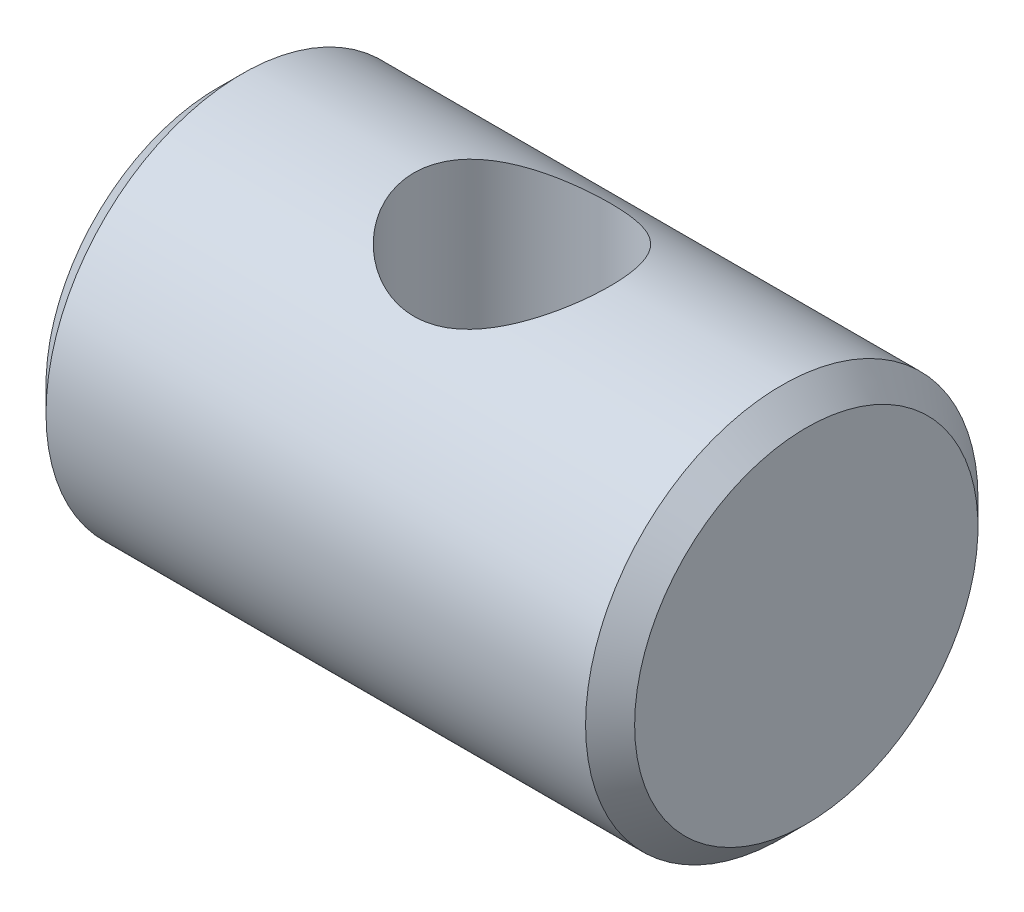
ISO-10303-21;
HEADER;
FILE_DESCRIPTION(('STEP AP214'),'2;1');
FILE_NAME('part.step','',(''),(''),'','','');
FILE_SCHEMA(('AUTOMOTIVE_DESIGN { 1 0 10303 214 1 1 1 1 }'));
ENDSEC;
DATA;
#1=APPLICATION_CONTEXT('core data for automotive mechanical design processes');
#2=APPLICATION_PROTOCOL_DEFINITION('international standard','automotive_design',2000,#1);
#3=PRODUCT_CONTEXT('',#1,'mechanical');
#4=PRODUCT('Part','Part','',(#3));
#5=PRODUCT_RELATED_PRODUCT_CATEGORY('part','',(#4));
#6=PRODUCT_DEFINITION_FORMATION('','',#4);
#7=PRODUCT_DEFINITION_CONTEXT('part definition',#1,'design');
#8=PRODUCT_DEFINITION('design','',#6,#7);
#9=PRODUCT_DEFINITION_SHAPE('','',#8);
#10=(LENGTH_UNIT() NAMED_UNIT(*) SI_UNIT(.MILLI.,.METRE.));
#11=(NAMED_UNIT(*) PLANE_ANGLE_UNIT() SI_UNIT($,.RADIAN.));
#12=(NAMED_UNIT(*) SI_UNIT($,.STERADIAN.) SOLID_ANGLE_UNIT());
#13=UNCERTAINTY_MEASURE_WITH_UNIT(LENGTH_MEASURE(1.E-05),#10,'distance_accuracy_value','');
#14=(GEOMETRIC_REPRESENTATION_CONTEXT(3) GLOBAL_UNCERTAINTY_ASSIGNED_CONTEXT((#13)) GLOBAL_UNIT_ASSIGNED_CONTEXT((#10,
#11,#12)) REPRESENTATION_CONTEXT('',''));
#15=CARTESIAN_POINT('',(0.,0.,0.));
#16=DIRECTION('',(0.,0.,1.));
#17=DIRECTION('',(1.,0.,0.));
#18=AXIS2_PLACEMENT_3D('',#15,#16,#17);
#19=CARTESIAN_POINT('',(0.,0.,0.));
#20=DIRECTION('',(-1.,0.,0.));
#21=DIRECTION('',(0.,0.,1.));
#22=AXIS2_PLACEMENT_3D('',#19,#20,#21);
#23=CYLINDRICAL_SURFACE('',#22,8.);
#24=CARTESIAN_POINT('',(23.,0.,0.));
#25=DIRECTION('',(-1.,0.,0.));
#26=DIRECTION('',(0.,0.,1.));
#27=AXIS2_PLACEMENT_3D('',#24,#25,#26);
#28=CIRCLE('',#27,8.);
#29=CARTESIAN_POINT('',(23.,0.,8.));
#30=VERTEX_POINT('',#29);
#31=EDGE_CURVE('E43',#30,#30,#28,.T.);
#32=ORIENTED_EDGE('',*,*,#31,.T.);
#33=EDGE_LOOP('',(#32));
#34=FACE_BOUND('',#33,.T.);
#35=CARTESIAN_POINT('',(0.999999999999997,0.,0.));
#36=DIRECTION('',(1.,0.,0.));
#37=DIRECTION('',(0.,0.,-1.));
#38=AXIS2_PLACEMENT_3D('',#35,#36,#37);
#39=CIRCLE('',#38,8.);
#40=CARTESIAN_POINT('',(0.999999999999997,0.,-8.));
#41=VERTEX_POINT('',#40);
#42=EDGE_CURVE('E47',#41,#41,#39,.T.);
#43=ORIENTED_EDGE('',*,*,#42,.T.);
#44=EDGE_LOOP('',(#43));
#45=FACE_BOUND('',#44,.T.);
#46=CARTESIAN_POINT('',(12.,-6.92820323027551,4.));
#47=CARTESIAN_POINT('',(11.8957346745627,-6.92820386262827,3.99999950219345));
#48=CARTESIAN_POINT('',(11.7914600733206,-6.93056511456489,3.9959176319954));
#49=CARTESIAN_POINT('',(11.5837158253996,-6.93992172463862,3.97964472112407));
#50=CARTESIAN_POINT('',(11.4802465761673,-6.94691924018482,3.96744990521398));
#51=CARTESIAN_POINT('',(11.2747891544301,-6.96530330045203,3.93508538297522));
#52=CARTESIAN_POINT('',(11.1728035661705,-6.97669672816262,3.91490316893164));
#53=CARTESIAN_POINT('',(10.9711859983217,-7.00345973447504,3.86682062971258));
#54=CARTESIAN_POINT('',(10.8715550619573,-7.01883104071991,3.83891695064122));
#55=CARTESIAN_POINT('',(10.5783110339908,-7.06996541785761,3.74442772916634));
#56=CARTESIAN_POINT('',(10.389014143383,-7.11087904783326,3.66684915651285));
#57=CARTESIAN_POINT('',(10.026270436199,-7.20170927952068,3.48506075380109));
#58=CARTESIAN_POINT('',(9.85282447778058,-7.25162636823861,3.38084948302616));
#59=CARTESIAN_POINT('',(9.51079150565206,-7.35987226264081,3.13867639492104));
#60=CARTESIAN_POINT('',(9.34378513355238,-7.41855528289904,2.99863981046008));
#61=CARTESIAN_POINT('',(9.03434475935065,-7.53488657765781,2.69298354883075));
#62=CARTESIAN_POINT('',(8.89192301423607,-7.59253432325009,2.52735118809493));
#63=CARTESIAN_POINT('',(8.69501793351785,-7.6758759355965,2.25626437810991));
#64=CARTESIAN_POINT('',(8.63046773838086,-7.70394919240219,2.15870290429515));
#65=CARTESIAN_POINT('',(8.50989555977189,-7.75744193796062,1.95777427065882));
#66=CARTESIAN_POINT('',(8.45386995399076,-7.78286255243594,1.85440960246323));
#67=CARTESIAN_POINT('',(8.35088721834241,-7.83032159918279,1.64251485422606));
#68=CARTESIAN_POINT('',(8.3039299474101,-7.85236008406492,1.53398485456801));
#69=CARTESIAN_POINT('',(8.21963805173427,-7.89238619731919,1.31258580967489));
#70=CARTESIAN_POINT('',(8.18229801231068,-7.91037610439248,1.19971924732414));
#71=CARTESIAN_POINT('',(8.11998170572534,-7.94064573590697,0.978622575683237));
#72=CARTESIAN_POINT('',(8.09431784694156,-7.95323930006917,0.870629018183686));
#73=CARTESIAN_POINT('',(8.05202029256653,-7.97409583861317,0.652524088435718));
#74=CARTESIAN_POINT('',(8.03538217848428,-7.98236093189932,0.542413779814406));
#75=CARTESIAN_POINT('',(8.01134413300253,-7.99432715952591,0.320973525125332));
#76=CARTESIAN_POINT('',(8.00394155328386,-7.99802960221736,0.209643937931223));
#77=CARTESIAN_POINT('',(7.99846831363001,-8.0007656004484,-0.0132971447801776));
#78=CARTESIAN_POINT('',(8.00039708275485,-7.99979944163708,-0.124908622632319));
#79=CARTESIAN_POINT('',(8.01298520870728,-7.99351360464185,-0.337727985342427));
#80=CARTESIAN_POINT('',(8.02286802234914,-7.98858118408677,-0.438993817716942));
#81=CARTESIAN_POINT('',(8.05026327909606,-7.97497880011988,-0.640243249291358));
#82=CARTESIAN_POINT('',(8.06777817913607,-7.96630763313356,-0.740226424897069));
#83=CARTESIAN_POINT('',(8.13151052269444,-7.93497195498556,-1.03714138295469));
#84=CARTESIAN_POINT('',(8.18892789700107,-7.9069787607081,-1.23123936013571));
#85=CARTESIAN_POINT('',(8.3323339738856,-7.83886272517952,-1.60926871560141));
#86=CARTESIAN_POINT('',(8.41870698240342,-7.79857742343273,-1.79302228049015));
#87=CARTESIAN_POINT('',(8.61705193447081,-7.70950607728793,-2.14389861654609));
#88=CARTESIAN_POINT('',(8.72903304281444,-7.66071699099023,-2.31101540282593));
#89=CARTESIAN_POINT('',(8.98758491999729,-7.55377539869557,-2.64069813790285));
#90=CARTESIAN_POINT('',(9.13642476015339,-7.49517374441381,-2.80134064782814));
#91=CARTESIAN_POINT('',(9.45834624318657,-7.37817491997774,-3.096413130151));
#92=CARTESIAN_POINT('',(9.63144636282433,-7.31977794078032,-3.23082293513643));
#93=CARTESIAN_POINT('',(10.0106428886681,-7.20576112808082,-3.47803613314164));
#94=CARTESIAN_POINT('',(10.2181366185476,-7.15055315383099,-3.58892539602578));
#95=CARTESIAN_POINT('',(10.5434173844388,-7.07886925416583,-3.72723782010755));
#96=CARTESIAN_POINT('',(10.6542083591974,-7.05682593849463,-3.76867730715226));
#97=CARTESIAN_POINT('',(10.8797448467812,-7.01731299636541,-3.84175062064907));
#98=CARTESIAN_POINT('',(10.9944878725261,-6.99984055082837,-3.873390493228));
#99=CARTESIAN_POINT('',(11.2178286645174,-6.97140602598866,-3.92431909326377));
#100=CARTESIAN_POINT('',(11.3261986514601,-6.96003957007804,-3.94438433855719));
#101=CARTESIAN_POINT('',(11.5445809004778,-6.94230335544128,-3.97551851361913));
#102=CARTESIAN_POINT('',(11.6545922781344,-6.93593099829036,-3.98659212183614));
#103=CARTESIAN_POINT('',(11.8752925100327,-6.92844811909924,-3.99958291311109));
#104=CARTESIAN_POINT('',(11.9859810966268,-6.92733563775175,-4.00150350567568));
#105=CARTESIAN_POINT('',(12.2070566931056,-6.93041539174955,-3.99616718095744));
#106=CARTESIAN_POINT('',(12.3174437228426,-6.93460726902939,-3.98891088315149));
#107=CARTESIAN_POINT('',(12.5248693839796,-6.94737197203376,-3.96663154579714));
#108=CARTESIAN_POINT('',(12.6220432110123,-6.95541341326252,-3.95254845698989));
#109=CARTESIAN_POINT('',(12.8147319334338,-6.97528372672039,-3.91737385475212));
#110=CARTESIAN_POINT('',(12.9102462700362,-6.98711384958699,-3.89628002700135));
#111=CARTESIAN_POINT('',(13.1933680361081,-7.02775685901555,-3.82280238446313));
#112=CARTESIAN_POINT('',(13.3776914342727,-7.06173163693377,-3.76020731695078));
#113=CARTESIAN_POINT('',(13.7416745877016,-7.14144993292041,-3.60658595732554));
#114=CARTESIAN_POINT('',(13.920722953339,-7.18766564346826,-3.51437713951607));
#115=CARTESIAN_POINT('',(14.2618701966871,-7.28624486618865,-3.30514737086267));
#116=CARTESIAN_POINT('',(14.4239603033081,-7.33861153030439,-3.18811367399408));
#117=CARTESIAN_POINT('',(14.7479131228582,-7.45151836616993,-2.91535761342628));
#118=CARTESIAN_POINT('',(14.9071715871659,-7.51225675092662,-2.75661800037809));
#119=CARTESIAN_POINT('',(15.1976659734158,-7.62937597657745,-2.41358105803055));
#120=CARTESIAN_POINT('',(15.3288924296162,-7.68575534144675,-2.22927513013699));
#121=CARTESIAN_POINT('',(15.5032077822372,-7.76335543938379,-1.93419225408146));
#122=CARTESIAN_POINT('',(15.5581300572987,-7.78834354202674,-1.83122945254024));
#123=CARTESIAN_POINT('',(15.659005530877,-7.83494183925332,-1.62028527572799));
#124=CARTESIAN_POINT('',(15.7049627631382,-7.85655355213899,-1.51230618469744));
#125=CARTESIAN_POINT('',(15.7873743266401,-7.89575152015211,-1.29213403393068));
#126=CARTESIAN_POINT('',(15.8238331581796,-7.91333968113673,-1.17994299872754));
#127=CARTESIAN_POINT('',(15.8868072609459,-7.94396070933363,-0.95219778660198));
#128=CARTESIAN_POINT('',(15.9133237112941,-7.95699411670659,-0.836644010238124));
#129=CARTESIAN_POINT('',(15.9540720499472,-7.97711749125789,-0.613942900584692));
#130=CARTESIAN_POINT('',(15.9692094727758,-7.98464383966398,-0.506999857370265));
#131=CARTESIAN_POINT('',(15.9907921133525,-7.99539449729097,-0.291983714868723));
#132=CARTESIAN_POINT('',(15.997234436371,-7.99861737381754,-0.183910251308575));
#133=CARTESIAN_POINT('',(16.0013301420855,-8.00066496370437,0.0323692027916311));
#134=CARTESIAN_POINT('',(15.9989896115844,-7.99949272302419,0.14057504961529));
#135=CARTESIAN_POINT('',(15.985562329174,-7.99278884324615,0.356345776551114));
#136=CARTESIAN_POINT('',(15.9744723721362,-7.9872556066098,0.463910407218422));
#137=CARTESIAN_POINT('',(15.9447060226096,-7.97248705040341,0.670402230454416));
#138=CARTESIAN_POINT('',(15.9265821512959,-7.96352188946078,0.769428771379721));
#139=CARTESIAN_POINT('',(15.8830300625117,-7.94213883037982,0.965494016558231));
#140=CARTESIAN_POINT('',(15.857599350826,-7.92971975328176,1.06253202988244));
#141=CARTESIAN_POINT('',(15.7707134042493,-7.88769036296796,1.34967669515382));
#142=CARTESIAN_POINT('',(15.69863845984,-7.85329454083082,1.535990515319));
#143=CARTESIAN_POINT('',(15.5250862227194,-7.77303546188782,1.90172389087137));
#144=CARTESIAN_POINT('',(15.4224832276661,-7.72674465907378,2.08050775123498));
#145=CARTESIAN_POINT('',(15.1921677558269,-7.62752535456451,2.41909138351715));
#146=CARTESIAN_POINT('',(15.0644437463676,-7.57459380826236,2.57888238184509));
#147=CARTESIAN_POINT('',(14.772819863122,-7.46114622775075,2.8916543099683));
#148=CARTESIAN_POINT('',(14.6065847731639,-7.40039963213063,3.04237488708293));
#149=CARTESIAN_POINT('',(14.2501623618277,-7.28251536809497,3.31466901461284));
#150=CARTESIAN_POINT('',(14.0599540747506,-7.22538092516391,3.43621677845464));
#151=CARTESIAN_POINT('',(13.756624263847,-7.14673032771598,3.59554085555899));
#152=CARTESIAN_POINT('',(13.6506989317317,-7.12134958638074,3.64540546855455));
#153=CARTESIAN_POINT('',(13.4341956230348,-7.07430377646636,3.7358834166029));
#154=CARTESIAN_POINT('',(13.3236200779381,-7.05263679540785,3.77650151690077));
#155=CARTESIAN_POINT('',(13.0988737005674,-7.01393620687008,3.8479016704483));
#156=CARTESIAN_POINT('',(12.984712965532,-6.99689069691894,3.87870902746065));
#157=CARTESIAN_POINT('',(12.7535262844232,-6.96811827819219,3.93016568856618));
#158=CARTESIAN_POINT('',(12.6365024019124,-6.95638765128934,3.95082209480824));
#159=CARTESIAN_POINT('',(12.4328016904566,-6.94118032889089,3.97745846425997));
#160=CARTESIAN_POINT('',(12.3465406270185,-6.93632575562014,3.98590343866333));
#161=CARTESIAN_POINT('',(12.1735218720144,-6.92983683549392,3.99717460159988));
#162=CARTESIAN_POINT('',(12.0867641476143,-6.92820270406464,4.00000041424856));
#163=CARTESIAN_POINT('',(12.,-6.92820323027551,4.));
#164=B_SPLINE_CURVE_WITH_KNOTS('',3,(#46,#47,#48,#49,#50,#51,#52,#53,#54,#55,#56,#57,#58,#59,
#60,#61,#62,#63,#64,#65,#66,#67,#68,#69,#70,#71,#72,#73,#74,#75,#76,#77,#78,#79,#80,#81,#82,#83,
#84,#85,#86,#87,#88,#89,#90,#91,#92,#93,#94,#95,#96,#97,#98,#99,#100,#101,#102,#103,#104,#105,
#106,#107,#108,#109,#110,#111,#112,#113,#114,#115,#116,#117,#118,#119,#120,#121,#122,#123,#124,
#125,#126,#127,#128,#129,#130,#131,#132,#133,#134,#135,#136,#137,#138,#139,#140,#141,#142,#143,
#144,#145,#146,#147,#148,#149,#150,#151,#152,#153,#154,#155,#156,#157,#158,#159,#160,#161,#162,
#163),.UNSPECIFIED.,.T.,.F.,(4,2,2,2,2,2,2,2,2,2,2,2,2,2,2,2,2,2,2,2,2,2,2,2,2,2,2,2,2,2,2,2,2,
2,2,2,2,2,2,2,2,2,2,2,2,2,2,2,2,2,2,2,2,2,2,2,2,2,4),(0.,0.312705907645189,0.625557430139017,
0.938900807369693,1.25238050266336,1.87532331508721,2.49829983322607,3.17265818143841,
3.84735177482031,4.20786878872692,4.568232179613,4.92858996431119,5.28874441516656,
5.62343001077676,5.95795161516748,6.29237727234833,6.62678246790365,6.93200651230821,
7.23732888766059,7.84737748897726,8.46586637752492,9.08457696228993,9.76177264655468,
10.4394869181158,11.160238657457,11.5207615871968,11.8810616378014,12.212984058814,
12.5447336660446,12.8763596865808,13.2079633222266,13.5031682056198,13.7984706362685,
14.38866539675,15.006195155551,15.6240427481094,16.319773042532,17.0157378984356,
17.3733524504477,17.7308057238246,18.0880893282017,18.4453305469501,18.7697157004161,
19.0942088199643,19.4184770967801,19.7428642161659,20.0457160884446,20.3486714633268,
20.9540518089476,21.585324497246,22.2168876724958,22.9113041424698,23.6063321822732,
23.9652997079033,24.3240818165632,24.6819309195696,25.0395292944428,25.2997293817866,
25.5599468741983),.UNSPECIFIED.);
#165=CARTESIAN_POINT('',(12.,-6.92820323027551,4.));
#166=VERTEX_POINT('',#165);
#167=EDGE_CURVE('E60',#166,#166,#164,.T.);
#168=ORIENTED_EDGE('',*,*,#167,.F.);
#169=EDGE_LOOP('',(#168));
#170=FACE_BOUND('',#169,.T.);
#171=CARTESIAN_POINT('',(12.,6.92820323027551,-4.));
#172=CARTESIAN_POINT('',(12.1042653254373,6.92820386262827,-3.99999950219345));
#173=CARTESIAN_POINT('',(12.2085399266794,6.93056511456489,-3.9959176319954));
#174=CARTESIAN_POINT('',(12.4162841746004,6.93992172463862,-3.97964472112407));
#175=CARTESIAN_POINT('',(12.5197534238327,6.94691924018482,-3.96744990521398));
#176=CARTESIAN_POINT('',(12.7252108455699,6.96530330045203,-3.93508538297522));
#177=CARTESIAN_POINT('',(12.8271964338295,6.97669672816262,-3.91490316893164));
#178=CARTESIAN_POINT('',(13.0288140016783,7.00345973447504,-3.86682062971258));
#179=CARTESIAN_POINT('',(13.1284449380427,7.01883104071991,-3.83891695064122));
#180=CARTESIAN_POINT('',(13.4216889660092,7.06996541785761,-3.74442772916634));
#181=CARTESIAN_POINT('',(13.610985856617,7.11087904783326,-3.66684915651285));
#182=CARTESIAN_POINT('',(13.973729563801,7.20170927952068,-3.48506075380109));
#183=CARTESIAN_POINT('',(14.1471755222194,7.25162636823861,-3.38084948302616));
#184=CARTESIAN_POINT('',(14.4892084943479,7.35987226264081,-3.13867639492104));
#185=CARTESIAN_POINT('',(14.6562148664476,7.41855528289904,-2.99863981046008));
#186=CARTESIAN_POINT('',(14.9656552406493,7.53488657765781,-2.69298354883075));
#187=CARTESIAN_POINT('',(15.1080769857639,7.59253432325009,-2.52735118809493));
#188=CARTESIAN_POINT('',(15.3049820664822,7.6758759355965,-2.25626437810991));
#189=CARTESIAN_POINT('',(15.3695322616191,7.70394919240219,-2.15870290429515));
#190=CARTESIAN_POINT('',(15.4901044402281,7.75744193796062,-1.95777427065882));
#191=CARTESIAN_POINT('',(15.5461300460092,7.78286255243594,-1.85440960246323));
#192=CARTESIAN_POINT('',(15.6491127816576,7.83032159918279,-1.64251485422606));
#193=CARTESIAN_POINT('',(15.6960700525899,7.85236008406492,-1.53398485456801));
#194=CARTESIAN_POINT('',(15.7803619482657,7.89238619731919,-1.31258580967489));
#195=CARTESIAN_POINT('',(15.8177019876893,7.91037610439248,-1.19971924732414));
#196=CARTESIAN_POINT('',(15.8800182942747,7.94064573590697,-0.978622575683237));
#197=CARTESIAN_POINT('',(15.9056821530584,7.95323930006917,-0.870629018183685));
#198=CARTESIAN_POINT('',(15.9479797074335,7.97409583861317,-0.652524088435717));
#199=CARTESIAN_POINT('',(15.9646178215157,7.98236093189932,-0.542413779814405));
#200=CARTESIAN_POINT('',(15.9886558669975,7.99432715952591,-0.320973525125331));
#201=CARTESIAN_POINT('',(15.9960584467161,7.99802960221736,-0.209643937931222));
#202=CARTESIAN_POINT('',(16.00153168637,8.0007656004484,0.0132971447801785));
#203=CARTESIAN_POINT('',(15.9996029172452,7.99979944163708,0.12490862263232));
#204=CARTESIAN_POINT('',(15.9870147912927,7.99351360464185,0.337727985342428));
#205=CARTESIAN_POINT('',(15.9771319776509,7.98858118408677,0.438993817716943));
#206=CARTESIAN_POINT('',(15.9497367209039,7.97497880011988,0.640243249291359));
#207=CARTESIAN_POINT('',(15.9322218208639,7.96630763313356,0.74022642489707));
#208=CARTESIAN_POINT('',(15.8684894773056,7.93497195498556,1.03714138295469));
#209=CARTESIAN_POINT('',(15.8110721029989,7.9069787607081,1.23123936013571));
#210=CARTESIAN_POINT('',(15.6676660261144,7.83886272517952,1.60926871560141));
#211=CARTESIAN_POINT('',(15.5812930175966,7.79857742343273,1.79302228049015));
#212=CARTESIAN_POINT('',(15.3829480655292,7.70950607728793,2.14389861654609));
#213=CARTESIAN_POINT('',(15.2709669571856,7.66071699099023,2.31101540282593));
#214=CARTESIAN_POINT('',(15.0124150800027,7.55377539869557,2.64069813790285));
#215=CARTESIAN_POINT('',(14.8635752398466,7.49517374441381,2.80134064782814));
#216=CARTESIAN_POINT('',(14.5416537568134,7.37817491997774,3.096413130151));
#217=CARTESIAN_POINT('',(14.3685536371757,7.31977794078032,3.23082293513643));
#218=CARTESIAN_POINT('',(13.9893571113319,7.20576112808082,3.47803613314164));
#219=CARTESIAN_POINT('',(13.7818633814524,7.15055315383099,3.58892539602578));
#220=CARTESIAN_POINT('',(13.4565826155612,7.07886925416583,3.72723782010755));
#221=CARTESIAN_POINT('',(13.3457916408027,7.05682593849463,3.76867730715226));
#222=CARTESIAN_POINT('',(13.1202551532188,7.01731299636541,3.84175062064907));
#223=CARTESIAN_POINT('',(13.0055121274739,6.99984055082837,3.873390493228));
#224=CARTESIAN_POINT('',(12.7821713354826,6.97140602598866,3.92431909326377));
#225=CARTESIAN_POINT('',(12.6738013485399,6.96003957007804,3.94438433855719));
#226=CARTESIAN_POINT('',(12.4554190995222,6.94230335544128,3.97551851361913));
#227=CARTESIAN_POINT('',(12.3454077218656,6.93593099829036,3.98659212183614));
#228=CARTESIAN_POINT('',(12.1247074899673,6.92844811909924,3.99958291311109));
#229=CARTESIAN_POINT('',(12.0140189033732,6.92733563775175,4.00150350567568));
#230=CARTESIAN_POINT('',(11.7929433068944,6.93041539174955,3.99616718095744));
#231=CARTESIAN_POINT('',(11.6825562771574,6.93460726902939,3.98891088315149));
#232=CARTESIAN_POINT('',(11.4751306160204,6.94737197203376,3.96663154579715));
#233=CARTESIAN_POINT('',(11.3779567889877,6.95541341326252,3.95254845698989));
#234=CARTESIAN_POINT('',(11.1852680665662,6.97528372672039,3.91737385475212));
#235=CARTESIAN_POINT('',(11.0897537299638,6.98711384958699,3.89628002700135));
#236=CARTESIAN_POINT('',(10.8066319638919,7.02775685901555,3.82280238446313));
#237=CARTESIAN_POINT('',(10.6223085657273,7.06173163693377,3.76020731695078));
#238=CARTESIAN_POINT('',(10.2583254122984,7.1414499329204,3.60658595732554));
#239=CARTESIAN_POINT('',(10.079277046661,7.18766564346826,3.51437713951607));
#240=CARTESIAN_POINT('',(9.73812980331288,7.28624486618865,3.30514737086267));
#241=CARTESIAN_POINT('',(9.57603969669191,7.33861153030439,3.18811367399408));
#242=CARTESIAN_POINT('',(9.25208687714178,7.45151836616993,2.91535761342628));
#243=CARTESIAN_POINT('',(9.0928284128341,7.51225675092662,2.7566180003781));
#244=CARTESIAN_POINT('',(8.80233402658416,7.62937597657745,2.41358105803055));
#245=CARTESIAN_POINT('',(8.67110757038376,7.68575534144675,2.22927513013699));
#246=CARTESIAN_POINT('',(8.49679221776281,7.76335543938379,1.93419225408146));
#247=CARTESIAN_POINT('',(8.44186994270129,7.78834354202674,1.83122945254024));
#248=CARTESIAN_POINT('',(8.34099446912297,7.83494183925332,1.62028527572799));
#249=CARTESIAN_POINT('',(8.29503723686177,7.85655355213899,1.51230618469744));
#250=CARTESIAN_POINT('',(8.21262567335987,7.89575152015211,1.29213403393068));
#251=CARTESIAN_POINT('',(8.17616684182038,7.91333968113673,1.17994299872755));
#252=CARTESIAN_POINT('',(8.11319273905409,7.94396070933363,0.952197786601981));
#253=CARTESIAN_POINT('',(8.08667628870593,7.95699411670659,0.836644010238125));
#254=CARTESIAN_POINT('',(8.04592795005278,7.97711749125789,0.613942900584693));
#255=CARTESIAN_POINT('',(8.03079052722419,7.98464383966398,0.506999857370266));
#256=CARTESIAN_POINT('',(8.00920788664753,7.99539449729097,0.291983714868724));
#257=CARTESIAN_POINT('',(8.00276556362899,7.99861737381754,0.183910251308577));
#258=CARTESIAN_POINT('',(7.9986698579145,8.00066496370437,-0.0323692027916298));
#259=CARTESIAN_POINT('',(8.00101038841558,7.99949272302419,-0.140575049615288));
#260=CARTESIAN_POINT('',(8.01443767082597,7.99278884324615,-0.356345776551112));
#261=CARTESIAN_POINT('',(8.02552762786376,7.9872556066098,-0.46391040721842));
#262=CARTESIAN_POINT('',(8.05529397739044,7.97248705040341,-0.670402230454415));
#263=CARTESIAN_POINT('',(8.0734178487041,7.96352188946078,-0.769428771379721));
#264=CARTESIAN_POINT('',(8.11696993748829,7.94213883037982,-0.965494016558231));
#265=CARTESIAN_POINT('',(8.14240064917404,7.92971975328176,-1.06253202988244));
#266=CARTESIAN_POINT('',(8.22928659575067,7.88769036296796,-1.34967669515382));
#267=CARTESIAN_POINT('',(8.30136154016002,7.85329454083082,-1.535990515319));
#268=CARTESIAN_POINT('',(8.47491377728062,7.77303546188782,-1.90172389087137));
#269=CARTESIAN_POINT('',(8.57751677233395,7.72674465907378,-2.08050775123498));
#270=CARTESIAN_POINT('',(8.80783224417312,7.62752535456451,-2.41909138351715));
#271=CARTESIAN_POINT('',(8.93555625363244,7.57459380826236,-2.57888238184509));
#272=CARTESIAN_POINT('',(9.22718013687798,7.46114622775076,-2.8916543099683));
#273=CARTESIAN_POINT('',(9.39341522683605,7.40039963213063,-3.04237488708293));
#274=CARTESIAN_POINT('',(9.74983763817228,7.28251536809497,-3.31466901461284));
#275=CARTESIAN_POINT('',(9.94004592524942,7.22538092516391,-3.43621677845464));
#276=CARTESIAN_POINT('',(10.243375736153,7.14673032771598,-3.59554085555899));
#277=CARTESIAN_POINT('',(10.3493010682683,7.12134958638074,-3.64540546855455));
#278=CARTESIAN_POINT('',(10.5658043769652,7.07430377646636,-3.7358834166029));
#279=CARTESIAN_POINT('',(10.6763799220619,7.05263679540785,-3.77650151690077));
#280=CARTESIAN_POINT('',(10.9011262994326,7.01393620687008,-3.8479016704483));
#281=CARTESIAN_POINT('',(11.015287034468,6.99689069691894,-3.87870902746065));
#282=CARTESIAN_POINT('',(11.2464737155768,6.96811827819219,-3.93016568856618));
#283=CARTESIAN_POINT('',(11.3634975980876,6.95638765128934,-3.95082209480824));
#284=CARTESIAN_POINT('',(11.5671983095434,6.94118032889089,-3.97745846425997));
#285=CARTESIAN_POINT('',(11.6534593729815,6.93632575562014,-3.98590343866333));
#286=CARTESIAN_POINT('',(11.8264781279856,6.92983683549392,-3.99717460159988));
#287=CARTESIAN_POINT('',(11.9132358523857,6.92820270406464,-4.00000041424856));
#288=CARTESIAN_POINT('',(12.,6.92820323027551,-4.));
#289=B_SPLINE_CURVE_WITH_KNOTS('',3,(#171,#172,#173,#174,#175,#176,#177,#178,#179,#180,#181,
#182,#183,#184,#185,#186,#187,#188,#189,#190,#191,#192,#193,#194,#195,#196,#197,#198,#199,#200,
#201,#202,#203,#204,#205,#206,#207,#208,#209,#210,#211,#212,#213,#214,#215,#216,#217,#218,#219,
#220,#221,#222,#223,#224,#225,#226,#227,#228,#229,#230,#231,#232,#233,#234,#235,#236,#237,#238,
#239,#240,#241,#242,#243,#244,#245,#246,#247,#248,#249,#250,#251,#252,#253,#254,#255,#256,#257,
#258,#259,#260,#261,#262,#263,#264,#265,#266,#267,#268,#269,#270,#271,#272,#273,#274,#275,#276,
#277,#278,#279,#280,#281,#282,#283,#284,#285,#286,#287,#288),.UNSPECIFIED.,.T.,.F.,(4,2,2,2,2,2,
2,2,2,2,2,2,2,2,2,2,2,2,2,2,2,2,2,2,2,2,2,2,2,2,2,2,2,2,2,2,2,2,2,2,2,2,2,2,2,2,2,2,2,2,2,2,2,2,
2,2,2,2,4),(0.,0.312705907645189,0.625557430139017,0.938900807369693,1.25238050266336,
1.87532331508721,2.49829983322607,3.17265818143841,3.84735177482031,4.20786878872692,
4.568232179613,4.92858996431119,5.28874441516656,5.62343001077676,5.95795161516748,
6.29237727234833,6.62678246790366,6.93200651230821,7.23732888766059,7.84737748897726,
8.46586637752493,9.08457696228993,9.76177264655468,10.4394869181158,11.160238657457,
11.5207615871968,11.8810616378014,12.212984058814,12.5447336660446,12.8763596865808,
13.2079633222266,13.5031682056198,13.7984706362685,14.38866539675,15.006195155551,
15.6240427481094,16.319773042532,17.0157378984356,17.3733524504477,17.7308057238246,
18.0880893282017,18.4453305469501,18.7697157004161,19.0942088199643,19.4184770967801,
19.7428642161659,20.0457160884446,20.3486714633268,20.9540518089476,21.585324497246,
22.2168876724958,22.9113041424698,23.6063321822732,23.9652997079033,24.3240818165632,
24.6819309195695,25.0395292944428,25.2997293817866,25.5599468741983),.UNSPECIFIED.);
#290=CARTESIAN_POINT('',(12.,6.92820323027551,-4.));
#291=VERTEX_POINT('',#290);
#292=EDGE_CURVE('E52',#291,#291,#289,.T.);
#293=ORIENTED_EDGE('',*,*,#292,.T.);
#294=EDGE_LOOP('',(#293));
#295=FACE_BOUND('',#294,.T.);
#296=ADVANCED_FACE('F32',(#34,#45,#170,#295),#23,.T.);
#297=CARTESIAN_POINT('',(0.,8.,0.));
#298=DIRECTION('',(1.,0.,0.));
#299=DIRECTION('',(0.,0.,-1.));
#300=AXIS2_PLACEMENT_3D('',#297,#298,#299);
#301=PLANE('',#300);
#302=CARTESIAN_POINT('',(0.,0.,0.));
#303=DIRECTION('',(1.,0.,0.));
#304=DIRECTION('',(0.,0.,-1.));
#305=AXIS2_PLACEMENT_3D('',#302,#303,#304);
#306=CIRCLE('',#305,7.);
#307=CARTESIAN_POINT('',(0.,0.,-7.));
#308=VERTEX_POINT('',#307);
#309=EDGE_CURVE('E10',#308,#308,#306,.F.);
#310=ORIENTED_EDGE('',*,*,#309,.T.);
#311=EDGE_LOOP('',(#310));
#312=FACE_BOUND('',#311,.T.);
#313=ADVANCED_FACE('F78',(#312),#301,.F.);
#314=CARTESIAN_POINT('',(24.,0.,0.));
#315=DIRECTION('',(-1.,0.,0.));
#316=DIRECTION('',(0.,0.,1.));
#317=AXIS2_PLACEMENT_3D('',#314,#315,#316);
#318=PLANE('',#317);
#319=CARTESIAN_POINT('',(24.,0.,0.));
#320=DIRECTION('',(-1.,0.,0.));
#321=DIRECTION('',(0.,0.,1.));
#322=AXIS2_PLACEMENT_3D('',#319,#320,#321);
#323=CIRCLE('',#322,7.);
#324=CARTESIAN_POINT('',(24.,0.,7.));
#325=VERTEX_POINT('',#324);
#326=EDGE_CURVE('E39',#325,#325,#323,.F.);
#327=ORIENTED_EDGE('',*,*,#326,.T.);
#328=EDGE_LOOP('',(#327));
#329=FACE_BOUND('',#328,.T.);
#330=ADVANCED_FACE('F74',(#329),#318,.F.);
#331=CARTESIAN_POINT('',(12.,8.001,0.));
#332=DIRECTION('',(0.,-1.,0.));
#333=DIRECTION('',(0.,0.,-1.));
#334=AXIS2_PLACEMENT_3D('',#331,#332,#333);
#335=CYLINDRICAL_SURFACE('',#334,4.);
#336=ORIENTED_EDGE('',*,*,#292,.F.);
#337=EDGE_LOOP('',(#336));
#338=FACE_BOUND('',#337,.T.);
#339=ORIENTED_EDGE('',*,*,#167,.T.);
#340=EDGE_LOOP('',(#339));
#341=FACE_BOUND('',#340,.T.);
#342=ADVANCED_FACE('F66',(#338,#341),#335,.F.);
#343=CARTESIAN_POINT('',(23.,0.,0.));
#344=DIRECTION('',(-1.,0.,0.));
#345=DIRECTION('',(0.,0.,1.));
#346=AXIS2_PLACEMENT_3D('',#343,#344,#345);
#347=CONICAL_SURFACE('',#346,8.,0.78539816339745);
#348=ORIENTED_EDGE('',*,*,#326,.F.);
#349=EDGE_LOOP('',(#348));
#350=FACE_BOUND('',#349,.T.);
#351=ORIENTED_EDGE('',*,*,#31,.F.);
#352=EDGE_LOOP('',(#351));
#353=FACE_BOUND('',#352,.T.);
#354=ADVANCED_FACE('F73',(#350,#353),#347,.T.);
#355=CARTESIAN_POINT('',(0.,0.,0.));
#356=DIRECTION('',(1.,0.,0.));
#357=DIRECTION('',(0.,0.,-1.));
#358=AXIS2_PLACEMENT_3D('',#355,#356,#357);
#359=CONICAL_SURFACE('',#358,7.,0.785398163397448);
#360=ORIENTED_EDGE('',*,*,#42,.F.);
#361=EDGE_LOOP('',(#360));
#362=FACE_BOUND('',#361,.T.);
#363=ORIENTED_EDGE('',*,*,#309,.F.);
#364=EDGE_LOOP('',(#363));
#365=FACE_BOUND('',#364,.T.);
#366=ADVANCED_FACE('F34',(#362,#365),#359,.T.);
#367=CLOSED_SHELL('',(#296,#313,#330,#342,#354,#366));
#368=MANIFOLD_SOLID_BREP('B2',#367);
#369=ADVANCED_BREP_SHAPE_REPRESENTATION('',(#18,#368),#14);
#370=SHAPE_DEFINITION_REPRESENTATION(#9,#369);
ENDSEC;
END-ISO-10303-21;
